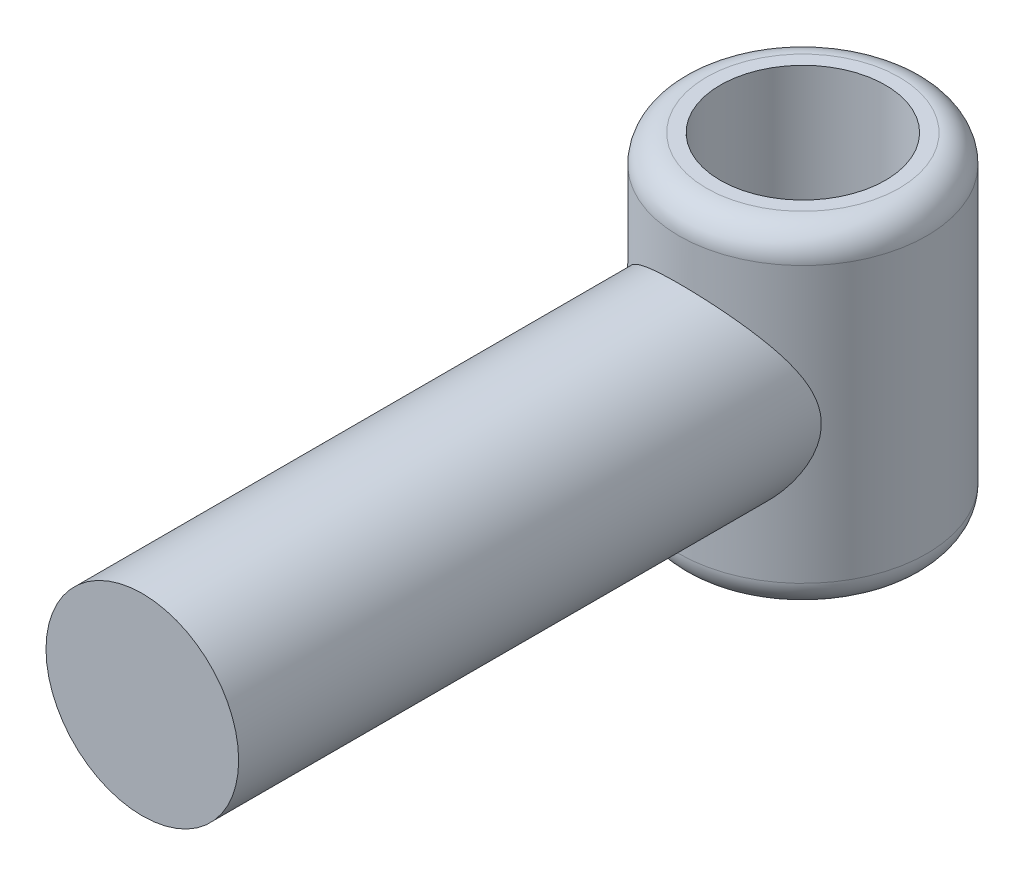
ISO-10303-21;
HEADER;
FILE_DESCRIPTION(('STEP AP214'),'2;1');
FILE_NAME('part.step','',(''),(''),'','','');
FILE_SCHEMA(('AUTOMOTIVE_DESIGN { 1 0 10303 214 1 1 1 1 }'));
ENDSEC;
DATA;
#1=APPLICATION_CONTEXT('core data for automotive mechanical design processes');
#2=APPLICATION_PROTOCOL_DEFINITION('international standard','automotive_design',2000,#1);
#3=PRODUCT_CONTEXT('',#1,'mechanical');
#4=PRODUCT('Part','Part','',(#3));
#5=PRODUCT_RELATED_PRODUCT_CATEGORY('part','',(#4));
#6=PRODUCT_DEFINITION_FORMATION('','',#4);
#7=PRODUCT_DEFINITION_CONTEXT('part definition',#1,'design');
#8=PRODUCT_DEFINITION('design','',#6,#7);
#9=PRODUCT_DEFINITION_SHAPE('','',#8);
#10=(LENGTH_UNIT() NAMED_UNIT(*) SI_UNIT(.MILLI.,.METRE.));
#11=(NAMED_UNIT(*) PLANE_ANGLE_UNIT() SI_UNIT($,.RADIAN.));
#12=(NAMED_UNIT(*) SI_UNIT($,.STERADIAN.) SOLID_ANGLE_UNIT());
#13=UNCERTAINTY_MEASURE_WITH_UNIT(LENGTH_MEASURE(1.E-05),#10,'distance_accuracy_value','');
#14=(GEOMETRIC_REPRESENTATION_CONTEXT(3) GLOBAL_UNCERTAINTY_ASSIGNED_CONTEXT((#13)) GLOBAL_UNIT_ASSIGNED_CONTEXT((#10,
#11,#12)) REPRESENTATION_CONTEXT('',''));
#15=CARTESIAN_POINT('',(0.,0.,0.));
#16=DIRECTION('',(0.,0.,1.));
#17=DIRECTION('',(1.,0.,0.));
#18=AXIS2_PLACEMENT_3D('',#15,#16,#17);
#19=CARTESIAN_POINT('',(0.,-38.1,0.));
#20=DIRECTION('',(0.,1.,0.));
#21=DIRECTION('',(0.,0.,1.));
#22=AXIS2_PLACEMENT_3D('',#19,#20,#21);
#23=CYLINDRICAL_SURFACE('',#22,28.575);
#24=CARTESIAN_POINT('',(0.,-31.75,0.));
#25=DIRECTION('',(0.,1.,0.));
#26=DIRECTION('',(0.,0.,1.));
#27=AXIS2_PLACEMENT_3D('',#24,#25,#26);
#28=CIRCLE('',#27,28.575);
#29=CARTESIAN_POINT('',(0.,-31.75,28.575));
#30=VERTEX_POINT('',#29);
#31=EDGE_CURVE('E43',#30,#30,#28,.T.);
#32=ORIENTED_EDGE('',*,*,#31,.T.);
#33=EDGE_LOOP('',(#32));
#34=FACE_BOUND('',#33,.T.);
#35=CARTESIAN_POINT('',(0.,31.75,0.));
#36=DIRECTION('',(0.,1.,0.));
#37=DIRECTION('',(0.,0.,1.));
#38=AXIS2_PLACEMENT_3D('',#35,#36,#37);
#39=CIRCLE('',#38,28.575);
#40=CARTESIAN_POINT('',(0.,31.75,28.575));
#41=VERTEX_POINT('',#40);
#42=EDGE_CURVE('E47',#41,#41,#39,.F.);
#43=ORIENTED_EDGE('',*,*,#42,.T.);
#44=EDGE_LOOP('',(#43));
#45=FACE_BOUND('',#44,.T.);
#46=CARTESIAN_POINT('',(-22.225,0.,17.9605122421383));
#47=CARTESIAN_POINT('',(-22.2249981761271,-0.509947377243593,17.9605163675638));
#48=CARTESIAN_POINT('',(-22.2073972562349,-1.01991560762269,17.9823607429363));
#49=CARTESIAN_POINT('',(-22.1375788612174,-2.03386781242111,18.0682369374865));
#50=CARTESIAN_POINT('',(-22.0853568983753,-2.5378510024137,18.1322742258704));
#51=CARTESIAN_POINT('',(-21.9476421499626,-3.53648013087578,18.2987221127167));
#52=CARTESIAN_POINT('',(-21.8620356291268,-4.03108802354015,18.401263844172));
#53=CARTESIAN_POINT('',(-21.6596163032722,-5.00596421694751,18.6390967504207));
#54=CARTESIAN_POINT('',(-21.54278951912,-5.48622598673298,18.7744025930644));
#55=CARTESIAN_POINT('',(-21.3313555436988,-6.24606148295115,19.0136402678806));
#56=CARTESIAN_POINT('',(-21.2458396662707,-6.53088701953215,19.1092412903133));
#57=CARTESIAN_POINT('',(-21.064486722943,-7.09404530575703,19.3089676845909));
#58=CARTESIAN_POINT('',(-20.9686537392201,-7.3723805707637,19.4130896810534));
#59=CARTESIAN_POINT('',(-20.6661560754234,-8.19781883874023,19.7364535713174));
#60=CARTESIAN_POINT('',(-20.4445278373633,-8.73522911829432,19.9666528677236));
#61=CARTESIAN_POINT('',(-19.963908178982,-9.78397170461022,20.4472160252181));
#62=CARTESIAN_POINT('',(-19.7048883381706,-10.2952837709327,20.6975951600126));
#63=CARTESIAN_POINT('',(-19.1513544254025,-11.2916312084983,21.210815671034));
#64=CARTESIAN_POINT('',(-18.8568438181037,-11.7766691379692,21.4736558292813));
#65=CARTESIAN_POINT('',(-18.2249033636916,-12.7334668580954,22.0127403614827));
#66=CARTESIAN_POINT('',(-17.8865191826987,-13.204499493684,22.2891547013513));
#67=CARTESIAN_POINT('',(-17.1741913310551,-14.1185508168687,22.842531266425));
#68=CARTESIAN_POINT('',(-16.8002462905631,-14.5615684242016,23.1194935123332));
#69=CARTESIAN_POINT('',(-16.0175468971588,-15.4183406897476,23.6684851825874));
#70=CARTESIAN_POINT('',(-15.6088164787983,-15.8321151160055,23.9405178449614));
#71=CARTESIAN_POINT('',(-14.756748948437,-16.6291685353315,24.4749232486672));
#72=CARTESIAN_POINT('',(-14.3134139221916,-17.0124493635609,24.7372965708045));
#73=CARTESIAN_POINT('',(-13.4132270409956,-17.7299825346552,25.2362607487843));
#74=CARTESIAN_POINT('',(-12.9578610720956,-18.0656594683725,25.4734796524728));
#75=CARTESIAN_POINT('',(-12.0167936734566,-18.7048330540129,25.9306945004148));
#76=CARTESIAN_POINT('',(-11.5310917761714,-19.0083292097617,26.1506901791011));
#77=CARTESIAN_POINT('',(-10.530993867525,-19.5801001083702,26.5692005378167));
#78=CARTESIAN_POINT('',(-10.0166178140807,-19.8483989238573,26.7677298828749));
#79=CARTESIAN_POINT('',(-8.96088514175917,-20.3468356396993,27.1393835774141));
#80=CARTESIAN_POINT('',(-8.41953313071817,-20.5769800284526,27.3125122458614));
#81=CARTESIAN_POINT('',(-7.39734869764901,-20.9638060377427,27.6052121980022));
#82=CARTESIAN_POINT('',(-6.91991132782651,-21.1263394855581,27.7289248883322));
#83=CARTESIAN_POINT('',(-5.95005657139964,-21.4197111688698,27.9530868056714));
#84=CARTESIAN_POINT('',(-5.45764061929001,-21.5505524288285,28.0535382525174));
#85=CARTESIAN_POINT('',(-4.46091530334056,-21.7787072991393,28.2291833291887));
#86=CARTESIAN_POINT('',(-3.95661197060194,-21.8760375362185,28.3043894841762));
#87=CARTESIAN_POINT('',(-2.93923584802347,-22.0358034962646,28.4280508199581));
#88=CARTESIAN_POINT('',(-2.42616295949651,-22.0982388262791,28.4765056995057));
#89=CARTESIAN_POINT('',(-1.39348105663726,-22.1873437252427,28.5457077081015));
#90=CARTESIAN_POINT('',(-0.873856995060696,-22.2139048427467,28.5663708189841));
#91=CARTESIAN_POINT('',(0.166330018093183,-22.2304638171505,28.5792493594412));
#92=CARTESIAN_POINT('',(0.686892971606772,-22.2204615985593,28.5714647302807));
#93=CARTESIAN_POINT('',(1.72489152481703,-22.1640604285865,28.5276227895711));
#94=CARTESIAN_POINT('',(2.24232677182873,-22.1176574470006,28.4915623473927));
#95=CARTESIAN_POINT('',(3.27005319392521,-21.9892146605658,28.3919692510702));
#96=CARTESIAN_POINT('',(3.78034447794535,-21.9071753997322,28.3284370163044));
#97=CARTESIAN_POINT('',(4.7674430897941,-21.7132138481249,28.1787160618405));
#98=CARTESIAN_POINT('',(5.24472400365489,-21.6028019801516,28.0936751994061));
#99=CARTESIAN_POINT('',(6.18674487423209,-21.3521048326145,27.901360467101));
#100=CARTESIAN_POINT('',(6.6514853037747,-21.2118206811329,27.7940874367991));
#101=CARTESIAN_POINT('',(7.56621082383919,-20.9030177591741,27.559138456894));
#102=CARTESIAN_POINT('',(8.0161943065737,-20.7344959243063,27.4314602929684));
#103=CARTESIAN_POINT('',(8.89955370645716,-20.3709777886302,27.1577324942974));
#104=CARTESIAN_POINT('',(9.33292863235822,-20.1759799107987,27.0116817652438));
#105=CARTESIAN_POINT('',(10.2257056687601,-19.7397403598902,26.6873360512603));
#106=CARTESIAN_POINT('',(10.683144170915,-19.4957999480534,26.5072678526976));
#107=CARTESIAN_POINT('',(11.5747195968558,-18.9800366315837,26.1302662888466));
#108=CARTESIAN_POINT('',(12.008855167446,-18.7082121103897,25.9333319458652));
#109=CARTESIAN_POINT('',(12.8531136449691,-18.138565317844,25.5254380244363));
#110=CARTESIAN_POINT('',(13.2632245942988,-17.8407302810946,25.3144715715783));
#111=CARTESIAN_POINT('',(14.0586475783932,-17.2208983318567,24.8815223023555));
#112=CARTESIAN_POINT('',(14.4439563938235,-16.8988982944358,24.6595380624706));
#113=CARTESIAN_POINT('',(15.2652542726774,-16.1643089934477,24.1614937427859));
#114=CARTESIAN_POINT('',(15.695595912577,-15.7466212267078,23.883623582752));
#115=CARTESIAN_POINT('',(16.5193282851356,-14.8801833564064,23.3214731649335));
#116=CARTESIAN_POINT('',(16.9127123385607,-14.431427663388,23.037191759932));
#117=CARTESIAN_POINT('',(17.6623120160786,-13.5036791234462,22.4676452464212));
#118=CARTESIAN_POINT('',(18.0184951364397,-13.0246604114654,22.1823794989526));
#119=CARTESIAN_POINT('',(18.6925265104982,-12.0373305241107,21.6174308857225));
#120=CARTESIAN_POINT('',(19.0103813119246,-11.5290243739766,21.3377470732161));
#121=CARTESIAN_POINT('',(19.5597717443509,-10.5651995719703,20.8341605493822));
#122=CARTESIAN_POINT('',(19.7970259513013,-10.1139124511171,20.6083911122009));
#123=CARTESIAN_POINT('',(20.2423157887557,-9.19032576304492,20.1711823660563));
#124=CARTESIAN_POINT('',(20.4503501190685,-8.71802526202828,19.9597436949828));
#125=CARTESIAN_POINT('',(20.8351975320917,-7.75334553703692,19.5576708880577));
#126=CARTESIAN_POINT('',(21.0120659510267,-7.26100385068185,19.3670001127583));
#127=CARTESIAN_POINT('',(21.3328305577148,-6.25610530153797,19.0131020187275));
#128=CARTESIAN_POINT('',(21.476738255696,-5.74355556912374,18.849865125116));
#129=CARTESIAN_POINT('',(21.6976386870698,-4.82968627964405,18.5947332052227));
#130=CARTESIAN_POINT('',(21.7823734679267,-4.43236767084159,18.4951893262983));
#131=CARTESIAN_POINT('',(21.9305704024309,-3.62871403142435,18.3192241307457));
#132=CARTESIAN_POINT('',(21.994035444481,-3.22238023305743,18.2427996746678));
#133=CARTESIAN_POINT('',(22.0985160687286,-2.40339985087082,18.1160974612562));
#134=CARTESIAN_POINT('',(22.1395657454864,-1.99076384131263,18.0657800001059));
#135=CARTESIAN_POINT('',(22.1985293064907,-1.16135087159268,17.9932802662405));
#136=CARTESIAN_POINT('',(22.2164433690045,-0.74457394336292,17.9710977767368));
#137=CARTESIAN_POINT('',(22.2287537528598,0.0911564688154476,17.9558691542049));
#138=CARTESIAN_POINT('',(22.2230772841251,0.510112699749429,17.9629132013961));
#139=CARTESIAN_POINT('',(22.1881728337977,1.34551737211884,18.0060089835651));
#140=CARTESIAN_POINT('',(22.1589449115708,1.76196581987293,18.042060645424));
#141=CARTESIAN_POINT('',(22.0775175584019,2.58980261311478,18.1416081576963));
#142=CARTESIAN_POINT('',(22.0252886555331,3.00118376823912,18.2051392165129));
#143=CARTESIAN_POINT('',(21.898851913005,3.81588124136771,18.3570321539279));
#144=CARTESIAN_POINT('',(21.8246407839242,4.21919634271818,18.4453977486659));
#145=CARTESIAN_POINT('',(21.6284947469892,5.14265409812941,18.6753406659234));
#146=CARTESIAN_POINT('',(21.4988882880814,5.65918500941057,18.8249039027876));
#147=CARTESIAN_POINT('',(21.2061988220615,6.67280733218253,19.1540117590821));
#148=CARTESIAN_POINT('',(21.0431038703518,7.16989173201406,19.3335670717423));
#149=CARTESIAN_POINT('',(20.6853269025577,8.14482559996552,19.7158959907648));
#150=CARTESIAN_POINT('',(20.4905664739511,8.6226235461769,19.9187268573427));
#151=CARTESIAN_POINT('',(20.0715801950791,9.55744129437829,20.3408652623513));
#152=CARTESIAN_POINT('',(19.8473539002538,10.0144607827376,20.5601730493526));
#153=CARTESIAN_POINT('',(19.2841703825953,11.0701352214774,21.0914813757171));
#154=CARTESIAN_POINT('',(18.933113872469,11.6599750691909,21.4082286965459));
#155=CARTESIAN_POINT('',(18.1807054726102,12.8015644106551,22.0507969948203));
#156=CARTESIAN_POINT('',(17.7793356777514,13.3533002352709,22.3766211702052));
#157=CARTESIAN_POINT('',(16.92771892405,14.4175993005762,23.0275951634512));
#158=CARTESIAN_POINT('',(16.4774945681787,14.9301804710298,23.352745222835));
#159=CARTESIAN_POINT('',(15.5288273315102,15.9145574685913,23.994037756727));
#160=CARTESIAN_POINT('',(15.0303983760826,16.3863650002737,24.310182798649));
#161=CARTESIAN_POINT('',(14.0721470592559,17.2121065449718,24.8749195528079));
#162=CARTESIAN_POINT('',(13.6195082110649,17.572649569101,25.1260552244247));
#163=CARTESIAN_POINT('',(12.6817100873906,18.2609717385666,25.612179037552));
#164=CARTESIAN_POINT('',(12.196551771855,18.5887518503261,25.847167655296));
#165=CARTESIAN_POINT('',(11.1955077295164,19.208259313739,26.2962312825059));
#166=CARTESIAN_POINT('',(10.6796635136998,19.5000337998409,26.5103335553486));
#167=CARTESIAN_POINT('',(9.61849044252663,20.0447186464134,26.9135136108313));
#168=CARTESIAN_POINT('',(9.07316677828698,20.2976358194325,27.1025957792421));
#169=CARTESIAN_POINT('',(8.04845541800912,20.7226346885895,27.4224621088285));
#170=CARTESIAN_POINT('',(7.57313032702125,20.9011661979239,27.557714123982));
#171=CARTESIAN_POINT('',(6.60599999962383,21.2266721420463,27.8054032304531));
#172=CARTESIAN_POINT('',(6.11419648262066,21.3736498574667,27.9178426935135));
#173=CARTESIAN_POINT('',(5.11698676130859,21.634059022666,28.1177087280177));
#174=CARTESIAN_POINT('',(4.61158584833126,21.7475033214902,28.205144879595));
#175=CARTESIAN_POINT('',(3.59025942807736,21.9392479202939,28.3532517920015));
#176=CARTESIAN_POINT('',(3.07433379295336,22.0175477930959,28.4139222274956));
#177=CARTESIAN_POINT('',(2.03379063166163,22.1379679265388,28.5073353870184));
#178=CARTESIAN_POINT('',(1.50914793400108,22.1799526877596,28.5399735133745));
#179=CARTESIAN_POINT('',(0.457195197178799,22.2265332652006,28.5761887762128));
#180=CARTESIAN_POINT('',(-0.070114846902737,22.2311290124331,28.5797658590735));
#181=CARTESIAN_POINT('',(-1.12311563752173,22.2028523646539,28.5577760991335));
#182=CARTESIAN_POINT('',(-1.6488063725721,22.1699797044593,28.5322090500648));
#183=CARTESIAN_POINT('',(-2.69436013830382,22.0673281324697,28.4525205242637));
#184=CARTESIAN_POINT('',(-3.21422332600651,21.9975502175274,28.3983998187979));
#185=CARTESIAN_POINT('',(-4.21408676529739,21.827370017757,28.2667889770465));
#186=CARTESIAN_POINT('',(-4.69464047601418,21.7289969836204,28.1908503458638));
#187=CARTESIAN_POINT('',(-5.64424280569001,21.5018946621384,28.0161776176156));
#188=CARTESIAN_POINT('',(-6.11329197271507,21.3731668239813,27.917444608796));
#189=CARTESIAN_POINT('',(-7.03751320906633,21.0869182336648,27.6989093088949));
#190=CARTESIAN_POINT('',(-7.4926836189336,20.9293940540064,27.5791045097974));
#191=CARTESIAN_POINT('',(-8.38712575645903,20.5872791533489,27.3203868740645));
#192=CARTESIAN_POINT('',(-8.82639654836772,20.4026868425123,27.1814729150889));
#193=CARTESIAN_POINT('',(-9.72611531430175,19.9904884242147,26.8733924314368));
#194=CARTESIAN_POINT('',(-10.1849285754681,19.7605092437894,26.7026299756615));
#195=CARTESIAN_POINT('',(-11.08034616017,19.27268932389,26.3436761202716));
#196=CARTESIAN_POINT('',(-11.5169493988086,19.0148472253093,26.1554838705248));
#197=CARTESIAN_POINT('',(-12.3670884795008,18.473220672214,25.764408604921));
#198=CARTESIAN_POINT('',(-12.7806153517253,18.1894262415295,25.5615199459947));
#199=CARTESIAN_POINT('',(-13.5837859116231,17.5977341101804,25.1439121696918));
#200=CARTESIAN_POINT('',(-13.9734264449982,17.2898332383247,24.9291914969235));
#201=CARTESIAN_POINT('',(-14.8032476559274,16.5881116718162,24.4472502517152));
#202=CARTESIAN_POINT('',(-15.2381261868421,16.1893614865838,24.1780631608726));
#203=CARTESIAN_POINT('',(-16.0724523334357,15.3613940155595,23.6316656894845));
#204=CARTESIAN_POINT('',(-16.4718943357284,14.932171922128,23.354454046987));
#205=CARTESIAN_POINT('',(-17.2352353711423,14.0442306715706,22.7969479582973));
#206=CARTESIAN_POINT('',(-17.5991004871138,13.5854840448916,22.5166508483633));
#207=CARTESIAN_POINT('',(-18.290255229976,12.6396307540628,21.9589227428254));
#208=CARTESIAN_POINT('',(-18.6175487963592,12.1525271531446,21.6814914414437));
#209=CARTESIAN_POINT('',(-19.2048966832448,11.1984544226613,21.1622559188477));
#210=CARTESIAN_POINT('',(-19.4683912578891,10.7340694841763,20.9195950468139));
#211=CARTESIAN_POINT('',(-19.9636826653578,9.78212036970929,20.4474697047836));
#212=CARTESIAN_POINT('',(-20.1954778491934,9.29455498966732,20.2180059216535));
#213=CARTESIAN_POINT('',(-20.6254809911916,8.29668770780644,19.7791417195603));
#214=CARTESIAN_POINT('',(-20.8237219582693,7.78640878209214,19.5697216717942));
#215=CARTESIAN_POINT('',(-21.1845670676494,6.74308374957668,19.1785189737169));
#216=CARTESIAN_POINT('',(-21.3471803653029,6.21004353398318,18.9967292268492));
#217=CARTESIAN_POINT('',(-21.6093466592672,5.21574061528097,18.6975758795168));
#218=CARTESIAN_POINT('',(-21.7149281172924,4.75779245180126,18.5745110840177));
#219=CARTESIAN_POINT('',(-21.8977498911158,3.82922198740832,18.3586287355756));
#220=CARTESIAN_POINT('',(-21.9749948345305,3.35860176944633,18.2658062440603));
#221=CARTESIAN_POINT('',(-22.0992028105235,2.40920583673825,18.1153372434651));
#222=CARTESIAN_POINT('',(-22.1462560800437,1.93045885588647,18.0575859415144));
#223=CARTESIAN_POINT('',(-22.2091552449609,0.967814111115767,17.9801718437307));
#224=CARTESIAN_POINT('',(-22.2250017307709,0.48391644481877,17.9605083273005));
#225=CARTESIAN_POINT('',(-22.225,0.,17.9605122421383));
#226=B_SPLINE_CURVE_WITH_KNOTS('',3,(#46,#47,#48,#49,#50,#51,#52,#53,#54,#55,#56,#57,#58,#59,
#60,#61,#62,#63,#64,#65,#66,#67,#68,#69,#70,#71,#72,#73,#74,#75,#76,#77,#78,#79,#80,#81,#82,#83,
#84,#85,#86,#87,#88,#89,#90,#91,#92,#93,#94,#95,#96,#97,#98,#99,#100,#101,#102,#103,#104,#105,
#106,#107,#108,#109,#110,#111,#112,#113,#114,#115,#116,#117,#118,#119,#120,#121,#122,#123,#124,
#125,#126,#127,#128,#129,#130,#131,#132,#133,#134,#135,#136,#137,#138,#139,#140,#141,#142,#143,
#144,#145,#146,#147,#148,#149,#150,#151,#152,#153,#154,#155,#156,#157,#158,#159,#160,#161,#162,
#163,#164,#165,#166,#167,#168,#169,#170,#171,#172,#173,#174,#175,#176,#177,#178,#179,#180,#181,
#182,#183,#184,#185,#186,#187,#188,#189,#190,#191,#192,#193,#194,#195,#196,#197,#198,#199,#200,
#201,#202,#203,#204,#205,#206,#207,#208,#209,#210,#211,#212,#213,#214,#215,#216,#217,#218,#219,
#220,#221,#222,#223,#224,#225),.UNSPECIFIED.,.T.,.F.,(4,2,2,2,2,2,2,2,2,2,2,2,2,2,2,2,2,2,2,2,2,
2,2,2,2,2,2,2,2,2,2,2,2,2,2,2,2,2,2,2,2,2,2,2,2,2,2,2,2,2,2,2,2,2,2,2,2,2,2,2,2,2,2,2,2,2,2,2,2,
2,2,2,2,2,2,2,2,2,2,2,2,2,2,2,2,2,2,2,2,4),(0.,1.52913444454137,3.05846714032118,
4.59305616856318,6.12833347649494,7.06512897612705,8.00155516612682,9.8748145860003,
11.7495053977986,13.6240133477009,15.5498445704302,17.4757500082472,19.4003408514668,
21.3248157814969,23.1634166605324,25.0020458836263,26.8394109775297,28.6764632948161,
30.2327607049228,31.7889095352191,33.3442851550392,34.8996782896264,36.4597630916213,
38.0198511146638,39.5801118912525,41.1403488500898,42.6303936954133,44.1203822813899,
45.6105326677332,47.1007718525999,48.7456012870228,50.3905261331929,52.0362628590205,
53.682212773654,55.6631809270464,57.6445064089343,59.6275488101868,61.6102519616235,
63.2818577128872,64.9535378217219,66.6222192188484,68.2903170035124,69.5440023871205,
70.7975174528492,72.0491205290642,73.3007139612303,74.5561721268107,75.8116271277846,
77.0686954871261,78.3259520493423,79.9828187026199,81.6402773530106,83.3019046556219,
84.9635570305656,87.2284571449696,89.4941655760648,91.7588301919094,94.0228425333738,
95.9135830508605,97.8042677798165,99.6924505756415,101.580301952453,103.155081242754,
104.729696724652,106.303708074533,107.877738555871,109.457617053992,111.037498467196,
112.617391062097,114.197240984492,115.684713368086,117.17211475167,118.659693289353,
120.147359234476,121.76846607248,123.389652021086,125.011463800242,126.633489287621,
128.577200880261,130.521219822262,132.467074380334,134.412719128202,136.170842761185,
137.92905781624,139.685533048061,141.441556382291,142.897270091804,144.352745963786,
145.803851190147,147.254928962234),.UNSPECIFIED.);
#227=CARTESIAN_POINT('',(-22.225,0.,17.9605122421383));
#228=VERTEX_POINT('',#227);
#229=EDGE_CURVE('E53',#228,#228,#226,.T.);
#230=ORIENTED_EDGE('',*,*,#229,.F.);
#231=EDGE_LOOP('',(#230));
#232=FACE_BOUND('',#231,.T.);
#233=ADVANCED_FACE('F32',(#34,#45,#232),#23,.T.);
#234=CARTESIAN_POINT('',(0.,-38.1,0.));
#235=DIRECTION('',(0.,1.,0.));
#236=DIRECTION('',(0.,0.,1.));
#237=AXIS2_PLACEMENT_3D('',#234,#235,#236);
#238=PLANE('',#237);
#239=CARTESIAN_POINT('',(0.,-38.1,0.));
#240=DIRECTION('',(0.,1.,0.));
#241=DIRECTION('',(0.,0.,1.));
#242=AXIS2_PLACEMENT_3D('',#239,#240,#241);
#243=CIRCLE('',#242,22.225);
#244=CARTESIAN_POINT('',(0.,-38.1,22.225));
#245=VERTEX_POINT('',#244);
#246=EDGE_CURVE('E39',#245,#245,#243,.F.);
#247=ORIENTED_EDGE('',*,*,#246,.T.);
#248=EDGE_LOOP('',(#247));
#249=FACE_BOUND('',#248,.T.);
#250=CARTESIAN_POINT('',(0.,-38.1,0.));
#251=DIRECTION('',(0.,1.,0.));
#252=DIRECTION('',(0.,0.,1.));
#253=AXIS2_PLACEMENT_3D('',#250,#251,#252);
#254=CIRCLE('',#253,19.05);
#255=CARTESIAN_POINT('',(0.,-38.1,19.05));
#256=VERTEX_POINT('',#255);
#257=EDGE_CURVE('E61',#256,#256,#254,.T.);
#258=ORIENTED_EDGE('',*,*,#257,.T.);
#259=EDGE_LOOP('',(#258));
#260=FACE_BOUND('',#259,.T.);
#261=ADVANCED_FACE('F69',(#249,#260),#238,.F.);
#262=CARTESIAN_POINT('',(0.,38.1,0.));
#263=DIRECTION('',(0.,1.,0.));
#264=DIRECTION('',(0.,0.,1.));
#265=AXIS2_PLACEMENT_3D('',#262,#263,#264);
#266=PLANE('',#265);
#267=CARTESIAN_POINT('',(0.,38.1,0.));
#268=DIRECTION('',(0.,1.,0.));
#269=DIRECTION('',(0.,0.,1.));
#270=AXIS2_PLACEMENT_3D('',#267,#268,#269);
#271=CIRCLE('',#270,22.225);
#272=CARTESIAN_POINT('',(0.,38.1,22.225));
#273=VERTEX_POINT('',#272);
#274=EDGE_CURVE('E10',#273,#273,#271,.T.);
#275=ORIENTED_EDGE('',*,*,#274,.T.);
#276=EDGE_LOOP('',(#275));
#277=FACE_BOUND('',#276,.T.);
#278=CARTESIAN_POINT('',(0.,38.1,0.));
#279=DIRECTION('',(0.,1.,0.));
#280=DIRECTION('',(0.,0.,1.));
#281=AXIS2_PLACEMENT_3D('',#278,#279,#280);
#282=CIRCLE('',#281,19.05);
#283=CARTESIAN_POINT('',(0.,38.1,19.05));
#284=VERTEX_POINT('',#283);
#285=EDGE_CURVE('E99',#284,#284,#282,.T.);
#286=ORIENTED_EDGE('',*,*,#285,.F.);
#287=EDGE_LOOP('',(#286));
#288=FACE_BOUND('',#287,.T.);
#289=ADVANCED_FACE('F83',(#277,#288),#266,.T.);
#290=CARTESIAN_POINT('',(0.,0.,152.4));
#291=DIRECTION('',(0.,0.,-1.));
#292=DIRECTION('',(-1.,0.,0.));
#293=AXIS2_PLACEMENT_3D('',#290,#291,#292);
#294=CYLINDRICAL_SURFACE('',#293,22.225);
#295=ORIENTED_EDGE('',*,*,#229,.T.);
#296=EDGE_LOOP('',(#295));
#297=FACE_BOUND('',#296,.T.);
#298=CARTESIAN_POINT('',(0.,0.,152.4));
#299=DIRECTION('',(0.,0.,1.));
#300=DIRECTION('',(1.,0.,0.));
#301=AXIS2_PLACEMENT_3D('',#298,#299,#300);
#302=CIRCLE('',#301,22.225);
#303=CARTESIAN_POINT('',(22.225,0.,152.4));
#304=VERTEX_POINT('',#303);
#305=EDGE_CURVE('E52',#304,#304,#302,.T.);
#306=ORIENTED_EDGE('',*,*,#305,.F.);
#307=EDGE_LOOP('',(#306));
#308=FACE_BOUND('',#307,.T.);
#309=ADVANCED_FACE('F63',(#297,#308),#294,.T.);
#310=CARTESIAN_POINT('',(0.,0.,152.4));
#311=DIRECTION('',(0.,0.,1.));
#312=DIRECTION('',(1.,0.,0.));
#313=AXIS2_PLACEMENT_3D('',#310,#311,#312);
#314=PLANE('',#313);
#315=ORIENTED_EDGE('',*,*,#305,.T.);
#316=EDGE_LOOP('',(#315));
#317=FACE_BOUND('',#316,.T.);
#318=ADVANCED_FACE('F72',(#317),#314,.T.);
#319=CARTESIAN_POINT('',(0.,-60.198,0.));
#320=DIRECTION('',(0.,1.,0.));
#321=DIRECTION('',(0.,0.,1.));
#322=AXIS2_PLACEMENT_3D('',#319,#320,#321);
#323=CYLINDRICAL_SURFACE('',#322,19.05);
#324=ORIENTED_EDGE('',*,*,#285,.T.);
#325=EDGE_LOOP('',(#324));
#326=FACE_BOUND('',#325,.T.);
#327=ORIENTED_EDGE('',*,*,#257,.F.);
#328=EDGE_LOOP('',(#327));
#329=FACE_BOUND('',#328,.T.);
#330=ADVANCED_FACE('F74',(#326,#329),#323,.F.);
#331=CARTESIAN_POINT('',(0.,-31.75,0.));
#332=DIRECTION('',(0.,1.,0.));
#333=DIRECTION('',(0.,0.,1.));
#334=AXIS2_PLACEMENT_3D('',#331,#332,#333);
#335=TOROIDAL_SURFACE('',#334,22.225,6.35);
#336=ORIENTED_EDGE('',*,*,#246,.F.);
#337=EDGE_LOOP('',(#336));
#338=FACE_BOUND('',#337,.T.);
#339=ORIENTED_EDGE('',*,*,#31,.F.);
#340=EDGE_LOOP('',(#339));
#341=FACE_BOUND('',#340,.T.);
#342=ADVANCED_FACE('F80',(#338,#341),#335,.T.);
#343=CARTESIAN_POINT('',(0.,31.75,0.));
#344=DIRECTION('',(0.,1.,0.));
#345=DIRECTION('',(0.,0.,1.));
#346=AXIS2_PLACEMENT_3D('',#343,#344,#345);
#347=TOROIDAL_SURFACE('',#346,22.225,6.35);
#348=ORIENTED_EDGE('',*,*,#42,.F.);
#349=EDGE_LOOP('',(#348));
#350=FACE_BOUND('',#349,.T.);
#351=ORIENTED_EDGE('',*,*,#274,.F.);
#352=EDGE_LOOP('',(#351));
#353=FACE_BOUND('',#352,.T.);
#354=ADVANCED_FACE('F34',(#350,#353),#347,.T.);
#355=CLOSED_SHELL('',(#233,#261,#289,#309,#318,#330,#342,#354));
#356=MANIFOLD_SOLID_BREP('B2',#355);
#357=ADVANCED_BREP_SHAPE_REPRESENTATION('',(#18,#356),#14);
#358=SHAPE_DEFINITION_REPRESENTATION(#9,#357);
ENDSEC;
END-ISO-10303-21;
